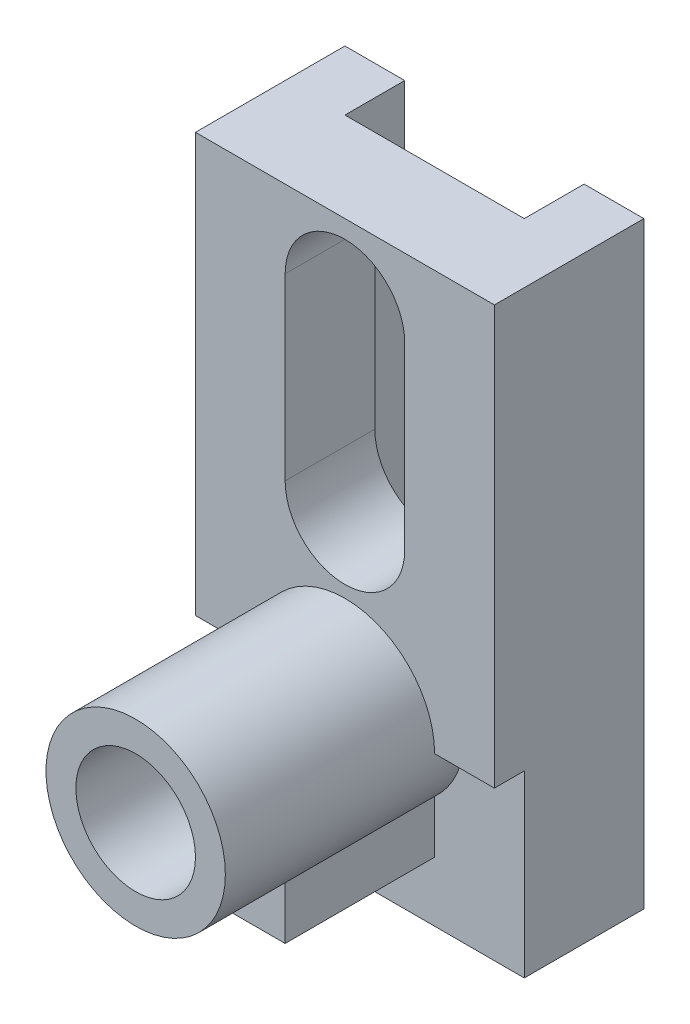
ISO-10303-21;
HEADER;
FILE_DESCRIPTION(('STEP AP214'),'2;1');
FILE_NAME('part.step','',(''),(''),'','','');
FILE_SCHEMA(('AUTOMOTIVE_DESIGN { 1 0 10303 214 1 1 1 1 }'));
ENDSEC;
DATA;
#1=APPLICATION_CONTEXT('core data for automotive mechanical design processes');
#2=APPLICATION_PROTOCOL_DEFINITION('international standard','automotive_design',2000,#1);
#3=PRODUCT_CONTEXT('',#1,'mechanical');
#4=PRODUCT('Part','Part','',(#3));
#5=PRODUCT_RELATED_PRODUCT_CATEGORY('part','',(#4));
#6=PRODUCT_DEFINITION_FORMATION('','',#4);
#7=PRODUCT_DEFINITION_CONTEXT('part definition',#1,'design');
#8=PRODUCT_DEFINITION('design','',#6,#7);
#9=PRODUCT_DEFINITION_SHAPE('','',#8);
#10=(LENGTH_UNIT() NAMED_UNIT(*) SI_UNIT(.MILLI.,.METRE.));
#11=(NAMED_UNIT(*) PLANE_ANGLE_UNIT() SI_UNIT($,.RADIAN.));
#12=(NAMED_UNIT(*) SI_UNIT($,.STERADIAN.) SOLID_ANGLE_UNIT());
#13=UNCERTAINTY_MEASURE_WITH_UNIT(LENGTH_MEASURE(1.E-05),#10,'distance_accuracy_value','');
#14=(GEOMETRIC_REPRESENTATION_CONTEXT(3) GLOBAL_UNCERTAINTY_ASSIGNED_CONTEXT((#13)) GLOBAL_UNIT_ASSIGNED_CONTEXT((#10,
#11,#12)) REPRESENTATION_CONTEXT('',''));
#15=CARTESIAN_POINT('',(0.,0.,0.));
#16=DIRECTION('',(0.,0.,1.));
#17=DIRECTION('',(1.,0.,0.));
#18=AXIS2_PLACEMENT_3D('',#15,#16,#17);
#19=CARTESIAN_POINT('',(0.,0.,0.));
#20=DIRECTION('',(0.,0.,-1.));
#21=DIRECTION('',(-1.,0.,0.));
#22=AXIS2_PLACEMENT_3D('',#19,#20,#21);
#23=PLANE('',#22);
#24=DIRECTION('',(0.,-1.,0.));
#25=VECTOR('',#24,1.);
#26=CARTESIAN_POINT('',(10.,100.,0.));
#27=LINE('',#26,#25);
#28=CARTESIAN_POINT('',(10.,100.,0.));
#29=VERTEX_POINT('',#28);
#30=CARTESIAN_POINT('',(10.,0.,0.));
#31=VERTEX_POINT('',#30);
#32=EDGE_CURVE('E190',#29,#31,#27,.T.);
#33=ORIENTED_EDGE('',*,*,#32,.T.);
#34=DIRECTION('',(1.,0.,0.));
#35=VECTOR('',#34,1.);
#36=CARTESIAN_POINT('',(0.,0.,0.));
#37=LINE('',#36,#35);
#38=CARTESIAN_POINT('',(0.,0.,0.));
#39=VERTEX_POINT('',#38);
#40=EDGE_CURVE('E221',#39,#31,#37,.T.);
#41=ORIENTED_EDGE('',*,*,#40,.F.);
#42=DIRECTION('',(0.,-1.,0.));
#43=VECTOR('',#42,1.);
#44=CARTESIAN_POINT('',(0.,0.,0.));
#45=LINE('',#44,#43);
#46=CARTESIAN_POINT('',(0.,100.,0.));
#47=VERTEX_POINT('',#46);
#48=EDGE_CURVE('E214',#47,#39,#45,.T.);
#49=ORIENTED_EDGE('',*,*,#48,.F.);
#50=DIRECTION('',(-1.,0.,0.));
#51=VECTOR('',#50,1.);
#52=CARTESIAN_POINT('',(0.,100.,0.));
#53=LINE('',#52,#51);
#54=EDGE_CURVE('E207',#29,#47,#53,.T.);
#55=ORIENTED_EDGE('',*,*,#54,.F.);
#56=EDGE_LOOP('',(#33,#41,#49,#55));
#57=FACE_BOUND('',#56,.T.);
#58=ADVANCED_FACE('F54',(#57),#23,.T.);
#59=CARTESIAN_POINT('',(15.,0.,20.));
#60=DIRECTION('',(1.,0.,0.));
#61=DIRECTION('',(0.,0.,-1.));
#62=AXIS2_PLACEMENT_3D('',#59,#60,#61);
#63=PLANE('',#62);
#64=DIRECTION('',(0.,-1.,0.));
#65=VECTOR('',#64,1.);
#66=CARTESIAN_POINT('',(15.,18.819660112501,45.));
#67=LINE('',#66,#65);
#68=CARTESIAN_POINT('',(15.,18.819660112501,45.));
#69=VERTEX_POINT('',#68);
#70=CARTESIAN_POINT('',(15.,10.,45.));
#71=VERTEX_POINT('',#70);
#72=EDGE_CURVE('E332',#69,#71,#67,.T.);
#73=ORIENTED_EDGE('',*,*,#72,.F.);
#74=DIRECTION('',(0.,0.,1.));
#75=VECTOR('',#74,1.);
#76=CARTESIAN_POINT('',(15.,18.819660112501,20.));
#77=LINE('',#76,#75);
#78=CARTESIAN_POINT('',(15.,18.819660112501,20.));
#79=VERTEX_POINT('',#78);
#80=EDGE_CURVE('E283',#79,#69,#77,.T.);
#81=ORIENTED_EDGE('',*,*,#80,.F.);
#82=DIRECTION('',(0.,1.,0.));
#83=VECTOR('',#82,1.);
#84=CARTESIAN_POINT('',(15.,0.,20.));
#85=LINE('',#84,#83);
#86=CARTESIAN_POINT('',(15.,10.,20.));
#87=VERTEX_POINT('',#86);
#88=EDGE_CURVE('E287',#87,#79,#85,.T.);
#89=ORIENTED_EDGE('',*,*,#88,.F.);
#90=DIRECTION('',(0.,0.,1.));
#91=VECTOR('',#90,1.);
#92=CARTESIAN_POINT('',(15.,10.,20.));
#93=LINE('',#92,#91);
#94=EDGE_CURVE('E301',#87,#71,#93,.T.);
#95=ORIENTED_EDGE('',*,*,#94,.T.);
#96=EDGE_LOOP('',(#73,#81,#89,#95));
#97=FACE_BOUND('',#96,.T.);
#98=ADVANCED_FACE('F407',(#97),#63,.F.);
#99=CARTESIAN_POINT('',(0.,10.,20.));
#100=DIRECTION('',(0.,-1.,0.));
#101=DIRECTION('',(0.,0.,-1.));
#102=AXIS2_PLACEMENT_3D('',#99,#100,#101);
#103=PLANE('',#102);
#104=CARTESIAN_POINT('',(25.,10.,35.));
#105=DIRECTION('',(0.,-1.,0.));
#106=DIRECTION('',(0.,0.,-1.));
#107=AXIS2_PLACEMENT_3D('',#104,#105,#106);
#108=CIRCLE('',#107,5.);
#109=CARTESIAN_POINT('',(25.,10.,30.));
#110=VERTEX_POINT('',#109);
#111=EDGE_CURVE('E337',#110,#110,#108,.T.);
#112=ORIENTED_EDGE('',*,*,#111,.F.);
#113=EDGE_LOOP('',(#112));
#114=FACE_BOUND('',#113,.T.);
#115=DIRECTION('',(0.,0.,1.));
#116=VECTOR('',#115,1.);
#117=CARTESIAN_POINT('',(35.,10.,20.));
#118=LINE('',#117,#116);
#119=CARTESIAN_POINT('',(35.,10.,20.));
#120=VERTEX_POINT('',#119);
#121=CARTESIAN_POINT('',(35.,10.,45.));
#122=VERTEX_POINT('',#121);
#123=EDGE_CURVE('E298',#120,#122,#118,.T.);
#124=ORIENTED_EDGE('',*,*,#123,.T.);
#125=DIRECTION('',(1.,0.,0.));
#126=VECTOR('',#125,1.);
#127=CARTESIAN_POINT('',(15.,10.,45.));
#128=LINE('',#127,#126);
#129=EDGE_CURVE('E330',#71,#122,#128,.T.);
#130=ORIENTED_EDGE('',*,*,#129,.F.);
#131=ORIENTED_EDGE('',*,*,#94,.F.);
#132=DIRECTION('',(1.,0.,0.));
#133=VECTOR('',#132,1.);
#134=CARTESIAN_POINT('',(0.,10.,20.));
#135=LINE('',#134,#133);
#136=EDGE_CURVE('E308',#87,#120,#135,.T.);
#137=ORIENTED_EDGE('',*,*,#136,.T.);
#138=EDGE_LOOP('',(#124,#130,#131,#137));
#139=FACE_BOUND('',#138,.T.);
#140=ADVANCED_FACE('F416',(#114,#139),#103,.T.);
#141=CARTESIAN_POINT('',(35.,0.,20.));
#142=DIRECTION('',(1.,0.,0.));
#143=DIRECTION('',(0.,0.,-1.));
#144=AXIS2_PLACEMENT_3D('',#141,#142,#143);
#145=PLANE('',#144);
#146=DIRECTION('',(0.,0.,1.));
#147=VECTOR('',#146,1.);
#148=CARTESIAN_POINT('',(35.,18.819660112501,20.));
#149=LINE('',#148,#147);
#150=CARTESIAN_POINT('',(35.,18.819660112501,20.));
#151=VERTEX_POINT('',#150);
#152=CARTESIAN_POINT('',(35.,18.819660112501,45.));
#153=VERTEX_POINT('',#152);
#154=EDGE_CURVE('E295',#151,#153,#149,.T.);
#155=ORIENTED_EDGE('',*,*,#154,.T.);
#156=DIRECTION('',(0.,1.,0.));
#157=VECTOR('',#156,1.);
#158=CARTESIAN_POINT('',(35.,10.,45.));
#159=LINE('',#158,#157);
#160=EDGE_CURVE('E327',#122,#153,#159,.T.);
#161=ORIENTED_EDGE('',*,*,#160,.F.);
#162=ORIENTED_EDGE('',*,*,#123,.F.);
#163=DIRECTION('',(0.,1.,0.));
#164=VECTOR('',#163,1.);
#165=CARTESIAN_POINT('',(35.,0.,20.));
#166=LINE('',#165,#164);
#167=EDGE_CURVE('E310',#120,#151,#166,.T.);
#168=ORIENTED_EDGE('',*,*,#167,.T.);
#169=EDGE_LOOP('',(#155,#161,#162,#168));
#170=FACE_BOUND('',#169,.T.);
#171=ADVANCED_FACE('F420',(#170),#145,.T.);
#172=CARTESIAN_POINT('',(0.,0.,60.));
#173=DIRECTION('',(0.,1.,0.));
#174=DIRECTION('',(0.,0.,1.));
#175=AXIS2_PLACEMENT_3D('',#172,#173,#174);
#176=PLANE('',#175);
#177=ORIENTED_EDGE('',*,*,#40,.T.);
#178=DIRECTION('',(0.,0.,-1.));
#179=VECTOR('',#178,1.);
#180=CARTESIAN_POINT('',(10.,0.,0.));
#181=LINE('',#180,#179);
#182=CARTESIAN_POINT('',(10.,0.,10.));
#183=VERTEX_POINT('',#182);
#184=EDGE_CURVE('E196',#183,#31,#181,.T.);
#185=ORIENTED_EDGE('',*,*,#184,.F.);
#186=DIRECTION('',(-1.,0.,0.));
#187=VECTOR('',#186,1.);
#188=CARTESIAN_POINT('',(10.,0.,10.));
#189=LINE('',#188,#187);
#190=CARTESIAN_POINT('',(40.,0.,10.));
#191=VERTEX_POINT('',#190);
#192=EDGE_CURVE('E210',#191,#183,#189,.T.);
#193=ORIENTED_EDGE('',*,*,#192,.F.);
#194=DIRECTION('',(0.,0.,1.));
#195=VECTOR('',#194,1.);
#196=CARTESIAN_POINT('',(40.,0.,0.));
#197=LINE('',#196,#195);
#198=CARTESIAN_POINT('',(40.,0.,0.));
#199=VERTEX_POINT('',#198);
#200=EDGE_CURVE('E359',#199,#191,#197,.T.);
#201=ORIENTED_EDGE('',*,*,#200,.F.);
#202=CARTESIAN_POINT('',(50.,0.,0.));
#203=VERTEX_POINT('',#202);
#204=EDGE_CURVE('E238',#199,#203,#37,.T.);
#205=ORIENTED_EDGE('',*,*,#204,.T.);
#206=DIRECTION('',(0.,0.,-1.));
#207=VECTOR('',#206,1.);
#208=CARTESIAN_POINT('',(50.,0.,60.));
#209=LINE('',#208,#207);
#210=CARTESIAN_POINT('',(50.,0.,20.));
#211=VERTEX_POINT('',#210);
#212=EDGE_CURVE('E228',#211,#203,#209,.T.);
#213=ORIENTED_EDGE('',*,*,#212,.F.);
#214=DIRECTION('',(1.,0.,0.));
#215=VECTOR('',#214,1.);
#216=CARTESIAN_POINT('',(0.,0.,20.));
#217=LINE('',#216,#215);
#218=CARTESIAN_POINT('',(0.,0.,20.));
#219=VERTEX_POINT('',#218);
#220=EDGE_CURVE('E235',#219,#211,#217,.T.);
#221=ORIENTED_EDGE('',*,*,#220,.F.);
#222=DIRECTION('',(0.,0.,-1.));
#223=VECTOR('',#222,1.);
#224=CARTESIAN_POINT('',(0.,0.,60.));
#225=LINE('',#224,#223);
#226=EDGE_CURVE('E62',#219,#39,#225,.T.);
#227=ORIENTED_EDGE('',*,*,#226,.T.);
#228=EDGE_LOOP('',(#177,#185,#193,#201,#205,#213,#221,#227));
#229=FACE_BOUND('',#228,.T.);
#230=ADVANCED_FACE('F233',(#229),#176,.F.);
#231=CARTESIAN_POINT('',(0.,0.,60.));
#232=DIRECTION('',(0.,0.,-1.));
#233=DIRECTION('',(-1.,0.,0.));
#234=AXIS2_PLACEMENT_3D('',#231,#232,#233);
#235=PLANE('',#234);
#236=CARTESIAN_POINT('',(25.,30.,60.));
#237=DIRECTION('',(0.,0.,1.));
#238=DIRECTION('',(1.,0.,0.));
#239=AXIS2_PLACEMENT_3D('',#236,#237,#238);
#240=CIRCLE('',#239,10.);
#241=CARTESIAN_POINT('',(35.,30.,60.));
#242=VERTEX_POINT('',#241);
#243=EDGE_CURVE('E249',#242,#242,#240,.T.);
#244=ORIENTED_EDGE('',*,*,#243,.F.);
#245=EDGE_LOOP('',(#244));
#246=FACE_BOUND('',#245,.T.);
#247=CARTESIAN_POINT('',(25.,30.,60.));
#248=DIRECTION('',(0.,0.,1.));
#249=DIRECTION('',(1.,0.,0.));
#250=AXIS2_PLACEMENT_3D('',#247,#248,#249);
#251=CIRCLE('',#250,15.);
#252=CARTESIAN_POINT('',(40.,30.,60.));
#253=VERTEX_POINT('',#252);
#254=EDGE_CURVE('E246',#253,#253,#251,.T.);
#255=ORIENTED_EDGE('',*,*,#254,.T.);
#256=EDGE_LOOP('',(#255));
#257=FACE_BOUND('',#256,.T.);
#258=ADVANCED_FACE('F390',(#246,#257),#235,.F.);
#259=CARTESIAN_POINT('',(50.,0.,60.));
#260=DIRECTION('',(-1.,0.,0.));
#261=DIRECTION('',(0.,0.,1.));
#262=AXIS2_PLACEMENT_3D('',#259,#260,#261);
#263=PLANE('',#262);
#264=DIRECTION('',(0.,1.,0.));
#265=VECTOR('',#264,1.);
#266=CARTESIAN_POINT('',(50.,0.,25.));
#267=LINE('',#266,#265);
#268=CARTESIAN_POINT('',(50.,30.,25.));
#269=VERTEX_POINT('',#268);
#270=CARTESIAN_POINT('',(50.,100.,25.));
#271=VERTEX_POINT('',#270);
#272=EDGE_CURVE('E255',#269,#271,#267,.T.);
#273=ORIENTED_EDGE('',*,*,#272,.F.);
#274=DIRECTION('',(0.,0.,1.));
#275=VECTOR('',#274,1.);
#276=CARTESIAN_POINT('',(50.,30.,20.));
#277=LINE('',#276,#275);
#278=CARTESIAN_POINT('',(50.,30.,20.));
#279=VERTEX_POINT('',#278);
#280=EDGE_CURVE('E290',#279,#269,#277,.T.);
#281=ORIENTED_EDGE('',*,*,#280,.F.);
#282=DIRECTION('',(0.,1.,0.));
#283=VECTOR('',#282,1.);
#284=CARTESIAN_POINT('',(50.,0.,20.));
#285=LINE('',#284,#283);
#286=EDGE_CURVE('E316',#211,#279,#285,.T.);
#287=ORIENTED_EDGE('',*,*,#286,.F.);
#288=ORIENTED_EDGE('',*,*,#212,.T.);
#289=DIRECTION('',(0.,1.,0.));
#290=VECTOR('',#289,1.);
#291=CARTESIAN_POINT('',(50.,0.,0.));
#292=LINE('',#291,#290);
#293=CARTESIAN_POINT('',(50.,100.,0.));
#294=VERTEX_POINT('',#293);
#295=EDGE_CURVE('E216',#203,#294,#292,.T.);
#296=ORIENTED_EDGE('',*,*,#295,.T.);
#297=DIRECTION('',(0.,0.,-1.));
#298=VECTOR('',#297,1.);
#299=CARTESIAN_POINT('',(50.,100.,60.));
#300=LINE('',#299,#298);
#301=EDGE_CURVE('E226',#271,#294,#300,.T.);
#302=ORIENTED_EDGE('',*,*,#301,.F.);
#303=EDGE_LOOP('',(#273,#281,#287,#288,#296,#302));
#304=FACE_BOUND('',#303,.T.);
#305=ADVANCED_FACE('F393',(#304),#263,.F.);
#306=CARTESIAN_POINT('',(0.,100.,60.));
#307=DIRECTION('',(0.,-1.,0.));
#308=DIRECTION('',(0.,0.,-1.));
#309=AXIS2_PLACEMENT_3D('',#306,#307,#308);
#310=PLANE('',#309);
#311=DIRECTION('',(-1.,0.,0.));
#312=VECTOR('',#311,1.);
#313=CARTESIAN_POINT('',(10.,100.,10.));
#314=LINE('',#313,#312);
#315=CARTESIAN_POINT('',(40.,100.,10.));
#316=VERTEX_POINT('',#315);
#317=CARTESIAN_POINT('',(10.,100.,10.));
#318=VERTEX_POINT('',#317);
#319=EDGE_CURVE('E202',#316,#318,#314,.T.);
#320=ORIENTED_EDGE('',*,*,#319,.T.);
#321=DIRECTION('',(0.,0.,-1.));
#322=VECTOR('',#321,1.);
#323=CARTESIAN_POINT('',(10.,100.,0.));
#324=LINE('',#323,#322);
#325=EDGE_CURVE('E193',#318,#29,#324,.T.);
#326=ORIENTED_EDGE('',*,*,#325,.T.);
#327=ORIENTED_EDGE('',*,*,#54,.T.);
#328=DIRECTION('',(0.,0.,-1.));
#329=VECTOR('',#328,1.);
#330=CARTESIAN_POINT('',(0.,100.,60.));
#331=LINE('',#330,#329);
#332=CARTESIAN_POINT('',(0.,100.,25.));
#333=VERTEX_POINT('',#332);
#334=EDGE_CURVE('E219',#333,#47,#331,.T.);
#335=ORIENTED_EDGE('',*,*,#334,.F.);
#336=DIRECTION('',(-1.,0.,0.));
#337=VECTOR('',#336,1.);
#338=CARTESIAN_POINT('',(0.,100.,25.));
#339=LINE('',#338,#337);
#340=EDGE_CURVE('E253',#271,#333,#339,.T.);
#341=ORIENTED_EDGE('',*,*,#340,.F.);
#342=ORIENTED_EDGE('',*,*,#301,.T.);
#343=CARTESIAN_POINT('',(40.,100.,0.));
#344=VERTEX_POINT('',#343);
#345=EDGE_CURVE('E215',#294,#344,#53,.T.);
#346=ORIENTED_EDGE('',*,*,#345,.T.);
#347=DIRECTION('',(0.,0.,1.));
#348=VECTOR('',#347,1.);
#349=CARTESIAN_POINT('',(40.,100.,0.));
#350=LINE('',#349,#348);
#351=EDGE_CURVE('E69',#344,#316,#350,.T.);
#352=ORIENTED_EDGE('',*,*,#351,.T.);
#353=EDGE_LOOP('',(#320,#326,#327,#335,#341,#342,#346,#352));
#354=FACE_BOUND('',#353,.T.);
#355=ADVANCED_FACE('F205',(#354),#310,.F.);
#356=CARTESIAN_POINT('',(0.,0.,60.));
#357=DIRECTION('',(1.,0.,0.));
#358=DIRECTION('',(0.,0.,-1.));
#359=AXIS2_PLACEMENT_3D('',#356,#357,#358);
#360=PLANE('',#359);
#361=DIRECTION('',(0.,-1.,0.));
#362=VECTOR('',#361,1.);
#363=CARTESIAN_POINT('',(0.,0.,20.));
#364=LINE('',#363,#362);
#365=CARTESIAN_POINT('',(0.,30.,20.));
#366=VERTEX_POINT('',#365);
#367=EDGE_CURVE('E320',#366,#219,#364,.T.);
#368=ORIENTED_EDGE('',*,*,#367,.F.);
#369=DIRECTION('',(0.,0.,1.));
#370=VECTOR('',#369,1.);
#371=CARTESIAN_POINT('',(0.,30.,20.));
#372=LINE('',#371,#370);
#373=CARTESIAN_POINT('',(0.,30.,25.));
#374=VERTEX_POINT('',#373);
#375=EDGE_CURVE('E286',#366,#374,#372,.T.);
#376=ORIENTED_EDGE('',*,*,#375,.T.);
#377=DIRECTION('',(0.,-1.,0.));
#378=VECTOR('',#377,1.);
#379=CARTESIAN_POINT('',(0.,0.,25.));
#380=LINE('',#379,#378);
#381=EDGE_CURVE('E243',#333,#374,#380,.T.);
#382=ORIENTED_EDGE('',*,*,#381,.F.);
#383=ORIENTED_EDGE('',*,*,#334,.T.);
#384=ORIENTED_EDGE('',*,*,#48,.T.);
#385=ORIENTED_EDGE('',*,*,#226,.F.);
#386=EDGE_LOOP('',(#368,#376,#382,#383,#384,#385));
#387=FACE_BOUND('',#386,.T.);
#388=ADVANCED_FACE('F56',(#387),#360,.F.);
#389=DIRECTION('',(0.,-1.,0.));
#390=VECTOR('',#389,1.);
#391=CARTESIAN_POINT('',(40.,100.,0.));
#392=LINE('',#391,#390);
#393=EDGE_CURVE('E201',#344,#199,#392,.T.);
#394=ORIENTED_EDGE('',*,*,#393,.F.);
#395=ORIENTED_EDGE('',*,*,#345,.F.);
#396=ORIENTED_EDGE('',*,*,#295,.F.);
#397=ORIENTED_EDGE('',*,*,#204,.F.);
#398=EDGE_LOOP('',(#394,#395,#396,#397));
#399=FACE_BOUND('',#398,.T.);
#400=ADVANCED_FACE('F369',(#399),#23,.T.);
#401=CARTESIAN_POINT('',(25.,30.,25.));
#402=DIRECTION('',(0.,0.,1.));
#403=DIRECTION('',(1.,0.,0.));
#404=AXIS2_PLACEMENT_3D('',#401,#402,#403);
#405=CYLINDRICAL_SURFACE('',#404,15.);
#406=ORIENTED_EDGE('',*,*,#254,.F.);
#407=EDGE_LOOP('',(#406));
#408=FACE_BOUND('',#407,.T.);
#409=ORIENTED_EDGE('',*,*,#80,.T.);
#410=CARTESIAN_POINT('',(25.,30.,45.));
#411=DIRECTION('',(0.,0.,-1.));
#412=DIRECTION('',(1.,0.,0.));
#413=AXIS2_PLACEMENT_3D('',#410,#411,#412);
#414=CIRCLE('',#413,15.);
#415=EDGE_CURVE('E334',#153,#69,#414,.T.);
#416=ORIENTED_EDGE('',*,*,#415,.F.);
#417=ORIENTED_EDGE('',*,*,#154,.F.);
#418=CARTESIAN_POINT('',(25.,30.,20.));
#419=DIRECTION('',(0.,0.,1.));
#420=DIRECTION('',(1.,0.,0.));
#421=AXIS2_PLACEMENT_3D('',#418,#419,#420);
#422=CIRCLE('',#421,15.);
#423=CARTESIAN_POINT('',(40.,30.,20.));
#424=VERTEX_POINT('',#423);
#425=EDGE_CURVE('E312',#151,#424,#422,.T.);
#426=ORIENTED_EDGE('',*,*,#425,.T.);
#427=DIRECTION('',(0.,0.,1.));
#428=VECTOR('',#427,1.);
#429=CARTESIAN_POINT('',(40.,30.,20.));
#430=LINE('',#429,#428);
#431=CARTESIAN_POINT('',(40.,30.,25.));
#432=VERTEX_POINT('',#431);
#433=EDGE_CURVE('E292',#424,#432,#430,.T.);
#434=ORIENTED_EDGE('',*,*,#433,.T.);
#435=CARTESIAN_POINT('',(25.,30.,25.));
#436=DIRECTION('',(0.,0.,1.));
#437=DIRECTION('',(1.,0.,0.));
#438=AXIS2_PLACEMENT_3D('',#435,#436,#437);
#439=CIRCLE('',#438,15.);
#440=CARTESIAN_POINT('',(10.,30.,25.));
#441=VERTEX_POINT('',#440);
#442=EDGE_CURVE('E248',#432,#441,#439,.T.);
#443=ORIENTED_EDGE('',*,*,#442,.T.);
#444=DIRECTION('',(0.,0.,1.));
#445=VECTOR('',#444,1.);
#446=CARTESIAN_POINT('',(10.,30.,20.));
#447=LINE('',#446,#445);
#448=CARTESIAN_POINT('',(10.,30.,20.));
#449=VERTEX_POINT('',#448);
#450=EDGE_CURVE('E284',#449,#441,#447,.T.);
#451=ORIENTED_EDGE('',*,*,#450,.F.);
#452=EDGE_CURVE('E325',#449,#79,#422,.T.);
#453=ORIENTED_EDGE('',*,*,#452,.T.);
#454=EDGE_LOOP('',(#409,#416,#417,#426,#434,#443,#451,#453));
#455=FACE_BOUND('',#454,.T.);
#456=ADVANCED_FACE('F397',(#408,#455),#405,.T.);
#457=CARTESIAN_POINT('',(0.,0.,25.));
#458=DIRECTION('',(0.,0.,1.));
#459=DIRECTION('',(1.,0.,0.));
#460=AXIS2_PLACEMENT_3D('',#457,#458,#459);
#461=PLANE('',#460);
#462=CARTESIAN_POINT('',(25.,57.,25.));
#463=DIRECTION('',(0.,0.,1.));
#464=DIRECTION('',(1.,0.,0.));
#465=AXIS2_PLACEMENT_3D('',#462,#463,#464);
#466=CIRCLE('',#465,9.99999999999999);
#467=CARTESIAN_POINT('',(15.,57.,25.));
#468=VERTEX_POINT('',#467);
#469=CARTESIAN_POINT('',(35.,57.,25.));
#470=VERTEX_POINT('',#469);
#471=EDGE_CURVE('E280',#468,#470,#466,.T.);
#472=ORIENTED_EDGE('',*,*,#471,.F.);
#473=DIRECTION('',(0.,-1.,0.));
#474=VECTOR('',#473,1.);
#475=CARTESIAN_POINT('',(15.,57.,25.));
#476=LINE('',#475,#474);
#477=CARTESIAN_POINT('',(15.,87.,25.));
#478=VERTEX_POINT('',#477);
#479=EDGE_CURVE('E267',#478,#468,#476,.T.);
#480=ORIENTED_EDGE('',*,*,#479,.F.);
#481=CARTESIAN_POINT('',(25.,87.,25.));
#482=DIRECTION('',(0.,0.,1.));
#483=DIRECTION('',(1.,0.,0.));
#484=AXIS2_PLACEMENT_3D('',#481,#482,#483);
#485=CIRCLE('',#484,9.99999999999999);
#486=CARTESIAN_POINT('',(35.,87.,25.));
#487=VERTEX_POINT('',#486);
#488=EDGE_CURVE('E274',#487,#478,#485,.T.);
#489=ORIENTED_EDGE('',*,*,#488,.F.);
#490=DIRECTION('',(0.,1.,0.));
#491=VECTOR('',#490,1.);
#492=CARTESIAN_POINT('',(35.,57.,25.));
#493=LINE('',#492,#491);
#494=EDGE_CURVE('E277',#470,#487,#493,.T.);
#495=ORIENTED_EDGE('',*,*,#494,.F.);
#496=EDGE_LOOP('',(#472,#480,#489,#495));
#497=FACE_BOUND('',#496,.T.);
#498=ORIENTED_EDGE('',*,*,#442,.F.);
#499=DIRECTION('',(-1.,0.,0.));
#500=VECTOR('',#499,1.);
#501=CARTESIAN_POINT('',(0.,30.,25.));
#502=LINE('',#501,#500);
#503=EDGE_CURVE('E257',#269,#432,#502,.T.);
#504=ORIENTED_EDGE('',*,*,#503,.F.);
#505=ORIENTED_EDGE('',*,*,#272,.T.);
#506=ORIENTED_EDGE('',*,*,#340,.T.);
#507=ORIENTED_EDGE('',*,*,#381,.T.);
#508=DIRECTION('',(1.,0.,0.));
#509=VECTOR('',#508,1.);
#510=CARTESIAN_POINT('',(0.,30.,25.));
#511=LINE('',#510,#509);
#512=EDGE_CURVE('E240',#374,#441,#511,.T.);
#513=ORIENTED_EDGE('',*,*,#512,.T.);
#514=EDGE_LOOP('',(#498,#504,#505,#506,#507,#513));
#515=FACE_BOUND('',#514,.T.);
#516=ADVANCED_FACE('F386',(#497,#515),#461,.T.);
#517=CARTESIAN_POINT('',(25.,30.,25.));
#518=DIRECTION('',(0.,0.,1.));
#519=DIRECTION('',(1.,0.,0.));
#520=AXIS2_PLACEMENT_3D('',#517,#518,#519);
#521=CYLINDRICAL_SURFACE('',#520,10.);
#522=CARTESIAN_POINT('',(25.,30.,10.));
#523=DIRECTION('',(0.,0.,1.));
#524=DIRECTION('',(1.,0.,0.));
#525=AXIS2_PLACEMENT_3D('',#522,#523,#524);
#526=CIRCLE('',#525,10.);
#527=CARTESIAN_POINT('',(35.,30.,10.));
#528=VERTEX_POINT('',#527);
#529=EDGE_CURVE('E340',#528,#528,#526,.F.);
#530=ORIENTED_EDGE('',*,*,#529,.T.);
#531=EDGE_LOOP('',(#530));
#532=FACE_BOUND('',#531,.T.);
#533=ORIENTED_EDGE('',*,*,#243,.T.);
#534=EDGE_LOOP('',(#533));
#535=FACE_BOUND('',#534,.T.);
#536=ADVANCED_FACE('F382',(#532,#535),#521,.F.);
#537=CARTESIAN_POINT('',(25.,57.,-10.));
#538=DIRECTION('',(0.,0.,1.));
#539=DIRECTION('',(1.,0.,0.));
#540=AXIS2_PLACEMENT_3D('',#537,#538,#539);
#541=CYLINDRICAL_SURFACE('',#540,9.99999999999999);
#542=DIRECTION('',(0.,0.,1.));
#543=VECTOR('',#542,1.);
#544=CARTESIAN_POINT('',(35.,57.,-10.));
#545=LINE('',#544,#543);
#546=CARTESIAN_POINT('',(35.,57.,10.));
#547=VERTEX_POINT('',#546);
#548=EDGE_CURVE('E264',#547,#470,#545,.T.);
#549=ORIENTED_EDGE('',*,*,#548,.F.);
#550=CARTESIAN_POINT('',(25.,57.,10.));
#551=DIRECTION('',(0.,0.,1.));
#552=DIRECTION('',(1.,0.,0.));
#553=AXIS2_PLACEMENT_3D('',#550,#551,#552);
#554=CIRCLE('',#553,9.99999999999999);
#555=CARTESIAN_POINT('',(15.,57.,10.));
#556=VERTEX_POINT('',#555);
#557=EDGE_CURVE('E77',#547,#556,#554,.F.);
#558=ORIENTED_EDGE('',*,*,#557,.T.);
#559=DIRECTION('',(0.,0.,1.));
#560=VECTOR('',#559,1.);
#561=CARTESIAN_POINT('',(15.,57.,-10.));
#562=LINE('',#561,#560);
#563=EDGE_CURVE('E263',#556,#468,#562,.T.);
#564=ORIENTED_EDGE('',*,*,#563,.T.);
#565=ORIENTED_EDGE('',*,*,#471,.T.);
#566=EDGE_LOOP('',(#549,#558,#564,#565));
#567=FACE_BOUND('',#566,.T.);
#568=ADVANCED_FACE('F385',(#567),#541,.F.);
#569=CARTESIAN_POINT('',(15.,57.,-10.));
#570=DIRECTION('',(-1.,0.,0.));
#571=DIRECTION('',(0.,0.,1.));
#572=AXIS2_PLACEMENT_3D('',#569,#570,#571);
#573=PLANE('',#572);
#574=ORIENTED_EDGE('',*,*,#563,.F.);
#575=DIRECTION('',(0.,1.,0.));
#576=VECTOR('',#575,1.);
#577=CARTESIAN_POINT('',(15.,57.,10.));
#578=LINE('',#577,#576);
#579=CARTESIAN_POINT('',(15.,87.,10.));
#580=VERTEX_POINT('',#579);
#581=EDGE_CURVE('E346',#556,#580,#578,.T.);
#582=ORIENTED_EDGE('',*,*,#581,.T.);
#583=DIRECTION('',(0.,0.,1.));
#584=VECTOR('',#583,1.);
#585=CARTESIAN_POINT('',(15.,87.,-10.));
#586=LINE('',#585,#584);
#587=EDGE_CURVE('E269',#580,#478,#586,.T.);
#588=ORIENTED_EDGE('',*,*,#587,.T.);
#589=ORIENTED_EDGE('',*,*,#479,.T.);
#590=EDGE_LOOP('',(#574,#582,#588,#589));
#591=FACE_BOUND('',#590,.T.);
#592=ADVANCED_FACE('F472',(#591),#573,.F.);
#593=CARTESIAN_POINT('',(25.,87.,-10.));
#594=DIRECTION('',(0.,0.,1.));
#595=DIRECTION('',(1.,0.,0.));
#596=AXIS2_PLACEMENT_3D('',#593,#594,#595);
#597=CYLINDRICAL_SURFACE('',#596,9.99999999999999);
#598=ORIENTED_EDGE('',*,*,#587,.F.);
#599=CARTESIAN_POINT('',(25.,87.,10.));
#600=DIRECTION('',(0.,0.,1.));
#601=DIRECTION('',(1.,0.,0.));
#602=AXIS2_PLACEMENT_3D('',#599,#600,#601);
#603=CIRCLE('',#602,9.99999999999999);
#604=CARTESIAN_POINT('',(35.,87.,10.));
#605=VERTEX_POINT('',#604);
#606=EDGE_CURVE('E349',#580,#605,#603,.F.);
#607=ORIENTED_EDGE('',*,*,#606,.T.);
#608=DIRECTION('',(0.,0.,1.));
#609=VECTOR('',#608,1.);
#610=CARTESIAN_POINT('',(35.,87.,-10.));
#611=LINE('',#610,#609);
#612=EDGE_CURVE('E266',#605,#487,#611,.T.);
#613=ORIENTED_EDGE('',*,*,#612,.T.);
#614=ORIENTED_EDGE('',*,*,#488,.T.);
#615=EDGE_LOOP('',(#598,#607,#613,#614));
#616=FACE_BOUND('',#615,.T.);
#617=ADVANCED_FACE('F475',(#616),#597,.F.);
#618=CARTESIAN_POINT('',(35.,57.,-10.));
#619=DIRECTION('',(1.,0.,0.));
#620=DIRECTION('',(0.,0.,-1.));
#621=AXIS2_PLACEMENT_3D('',#618,#619,#620);
#622=PLANE('',#621);
#623=ORIENTED_EDGE('',*,*,#612,.F.);
#624=DIRECTION('',(0.,-1.,0.));
#625=VECTOR('',#624,1.);
#626=CARTESIAN_POINT('',(35.,57.,10.));
#627=LINE('',#626,#625);
#628=EDGE_CURVE('E12',#605,#547,#627,.T.);
#629=ORIENTED_EDGE('',*,*,#628,.T.);
#630=ORIENTED_EDGE('',*,*,#548,.T.);
#631=ORIENTED_EDGE('',*,*,#494,.T.);
#632=EDGE_LOOP('',(#623,#629,#630,#631));
#633=FACE_BOUND('',#632,.T.);
#634=ADVANCED_FACE('F467',(#633),#622,.F.);
#635=CARTESIAN_POINT('',(0.,30.,20.));
#636=DIRECTION('',(0.,1.,0.));
#637=DIRECTION('',(0.,0.,1.));
#638=AXIS2_PLACEMENT_3D('',#635,#636,#637);
#639=PLANE('',#638);
#640=ORIENTED_EDGE('',*,*,#503,.T.);
#641=ORIENTED_EDGE('',*,*,#433,.F.);
#642=DIRECTION('',(-1.,0.,0.));
#643=VECTOR('',#642,1.);
#644=CARTESIAN_POINT('',(0.,30.,20.));
#645=LINE('',#644,#643);
#646=EDGE_CURVE('E313',#279,#424,#645,.T.);
#647=ORIENTED_EDGE('',*,*,#646,.F.);
#648=ORIENTED_EDGE('',*,*,#280,.T.);
#649=EDGE_LOOP('',(#640,#641,#647,#648));
#650=FACE_BOUND('',#649,.T.);
#651=ADVANCED_FACE('F464',(#650),#639,.F.);
#652=CARTESIAN_POINT('',(0.,30.,20.));
#653=DIRECTION('',(0.,1.,0.));
#654=DIRECTION('',(0.,0.,1.));
#655=AXIS2_PLACEMENT_3D('',#652,#653,#654);
#656=PLANE('',#655);
#657=ORIENTED_EDGE('',*,*,#512,.F.);
#658=ORIENTED_EDGE('',*,*,#375,.F.);
#659=DIRECTION('',(-1.,0.,0.));
#660=VECTOR('',#659,1.);
#661=CARTESIAN_POINT('',(0.,30.,20.));
#662=LINE('',#661,#660);
#663=EDGE_CURVE('E322',#449,#366,#662,.T.);
#664=ORIENTED_EDGE('',*,*,#663,.F.);
#665=ORIENTED_EDGE('',*,*,#450,.T.);
#666=EDGE_LOOP('',(#657,#658,#664,#665));
#667=FACE_BOUND('',#666,.T.);
#668=ADVANCED_FACE('F432',(#667),#656,.F.);
#669=CARTESIAN_POINT('',(0.,0.,20.));
#670=DIRECTION('',(0.,0.,1.));
#671=DIRECTION('',(1.,0.,0.));
#672=AXIS2_PLACEMENT_3D('',#669,#670,#671);
#673=PLANE('',#672);
#674=ORIENTED_EDGE('',*,*,#452,.F.);
#675=ORIENTED_EDGE('',*,*,#663,.T.);
#676=ORIENTED_EDGE('',*,*,#367,.T.);
#677=ORIENTED_EDGE('',*,*,#220,.T.);
#678=ORIENTED_EDGE('',*,*,#286,.T.);
#679=ORIENTED_EDGE('',*,*,#646,.T.);
#680=ORIENTED_EDGE('',*,*,#425,.F.);
#681=ORIENTED_EDGE('',*,*,#167,.F.);
#682=ORIENTED_EDGE('',*,*,#136,.F.);
#683=ORIENTED_EDGE('',*,*,#88,.T.);
#684=EDGE_LOOP('',(#674,#675,#676,#677,#678,#679,#680,#681,#682,#683));
#685=FACE_BOUND('',#684,.T.);
#686=ADVANCED_FACE('F410',(#685),#673,.T.);
#687=CARTESIAN_POINT('',(25.,30.,45.));
#688=DIRECTION('',(0.,0.,1.));
#689=DIRECTION('',(1.,0.,0.));
#690=AXIS2_PLACEMENT_3D('',#687,#688,#689);
#691=PLANE('',#690);
#692=ORIENTED_EDGE('',*,*,#415,.T.);
#693=ORIENTED_EDGE('',*,*,#72,.T.);
#694=ORIENTED_EDGE('',*,*,#129,.T.);
#695=ORIENTED_EDGE('',*,*,#160,.T.);
#696=EDGE_LOOP('',(#692,#693,#694,#695));
#697=FACE_BOUND('',#696,.T.);
#698=ADVANCED_FACE('F422',(#697),#691,.T.);
#699=CARTESIAN_POINT('',(25.,18.,35.));
#700=DIRECTION('',(0.,-1.,0.));
#701=DIRECTION('',(0.,0.,-1.));
#702=AXIS2_PLACEMENT_3D('',#699,#700,#701);
#703=CYLINDRICAL_SURFACE('',#702,5.);
#704=CARTESIAN_POINT('',(25.,18.,35.));
#705=DIRECTION('',(0.,-1.,0.));
#706=DIRECTION('',(0.,0.,-1.));
#707=AXIS2_PLACEMENT_3D('',#704,#705,#706);
#708=CIRCLE('',#707,5.);
#709=CARTESIAN_POINT('',(25.,18.,30.));
#710=VERTEX_POINT('',#709);
#711=EDGE_CURVE('E336',#710,#710,#708,.T.);
#712=ORIENTED_EDGE('',*,*,#711,.F.);
#713=EDGE_LOOP('',(#712));
#714=FACE_BOUND('',#713,.T.);
#715=ORIENTED_EDGE('',*,*,#111,.T.);
#716=EDGE_LOOP('',(#715));
#717=FACE_BOUND('',#716,.T.);
#718=ADVANCED_FACE('F424',(#714,#717),#703,.F.);
#719=CARTESIAN_POINT('',(25.,18.,35.));
#720=DIRECTION('',(0.,-1.,0.));
#721=DIRECTION('',(0.,0.,-1.));
#722=AXIS2_PLACEMENT_3D('',#719,#720,#721);
#723=PLANE('',#722);
#724=ORIENTED_EDGE('',*,*,#711,.T.);
#725=EDGE_LOOP('',(#724));
#726=FACE_BOUND('',#725,.T.);
#727=ADVANCED_FACE('F378',(#726),#723,.T.);
#728=CARTESIAN_POINT('',(10.,100.,10.));
#729=DIRECTION('',(0.,0.,1.));
#730=DIRECTION('',(1.,0.,0.));
#731=AXIS2_PLACEMENT_3D('',#728,#729,#730);
#732=PLANE('',#731);
#733=ORIENTED_EDGE('',*,*,#628,.F.);
#734=ORIENTED_EDGE('',*,*,#606,.F.);
#735=ORIENTED_EDGE('',*,*,#581,.F.);
#736=ORIENTED_EDGE('',*,*,#557,.F.);
#737=EDGE_LOOP('',(#733,#734,#735,#736));
#738=FACE_BOUND('',#737,.T.);
#739=ORIENTED_EDGE('',*,*,#192,.T.);
#740=DIRECTION('',(0.,-1.,0.));
#741=VECTOR('',#740,1.);
#742=CARTESIAN_POINT('',(10.,100.,10.));
#743=LINE('',#742,#741);
#744=EDGE_CURVE('E351',#318,#183,#743,.T.);
#745=ORIENTED_EDGE('',*,*,#744,.F.);
#746=ORIENTED_EDGE('',*,*,#319,.F.);
#747=DIRECTION('',(0.,-1.,0.));
#748=VECTOR('',#747,1.);
#749=CARTESIAN_POINT('',(40.,100.,10.));
#750=LINE('',#749,#748);
#751=EDGE_CURVE('E354',#316,#191,#750,.T.);
#752=ORIENTED_EDGE('',*,*,#751,.T.);
#753=EDGE_LOOP('',(#739,#745,#746,#752));
#754=FACE_BOUND('',#753,.T.);
#755=ORIENTED_EDGE('',*,*,#529,.F.);
#756=EDGE_LOOP('',(#755));
#757=FACE_BOUND('',#756,.T.);
#758=ADVANCED_FACE('F375',(#738,#754,#757),#732,.F.);
#759=CARTESIAN_POINT('',(10.,100.,0.));
#760=DIRECTION('',(-1.,0.,0.));
#761=DIRECTION('',(0.,0.,1.));
#762=AXIS2_PLACEMENT_3D('',#759,#760,#761);
#763=PLANE('',#762);
#764=ORIENTED_EDGE('',*,*,#184,.T.);
#765=ORIENTED_EDGE('',*,*,#32,.F.);
#766=ORIENTED_EDGE('',*,*,#325,.F.);
#767=ORIENTED_EDGE('',*,*,#744,.T.);
#768=EDGE_LOOP('',(#764,#765,#766,#767));
#769=FACE_BOUND('',#768,.T.);
#770=ADVANCED_FACE('F192',(#769),#763,.F.);
#771=CARTESIAN_POINT('',(40.,100.,0.));
#772=DIRECTION('',(1.,0.,0.));
#773=DIRECTION('',(0.,0.,-1.));
#774=AXIS2_PLACEMENT_3D('',#771,#772,#773);
#775=PLANE('',#774);
#776=ORIENTED_EDGE('',*,*,#200,.T.);
#777=ORIENTED_EDGE('',*,*,#751,.F.);
#778=ORIENTED_EDGE('',*,*,#351,.F.);
#779=ORIENTED_EDGE('',*,*,#393,.T.);
#780=EDGE_LOOP('',(#776,#777,#778,#779));
#781=FACE_BOUND('',#780,.T.);
#782=ADVANCED_FACE('F372',(#781),#775,.F.);
#783=CLOSED_SHELL('',(#58,#98,#140,#171,#230,#258,#305,#355,#388,#400,#456,#516,#536,#568,#592,
#617,#634,#651,#668,#686,#698,#718,#727,#758,#770,#782));
#784=MANIFOLD_SOLID_BREP('B2',#783);
#785=ADVANCED_BREP_SHAPE_REPRESENTATION('',(#18,#784),#14);
#786=SHAPE_DEFINITION_REPRESENTATION(#9,#785);
ENDSEC;
END-ISO-10303-21;
